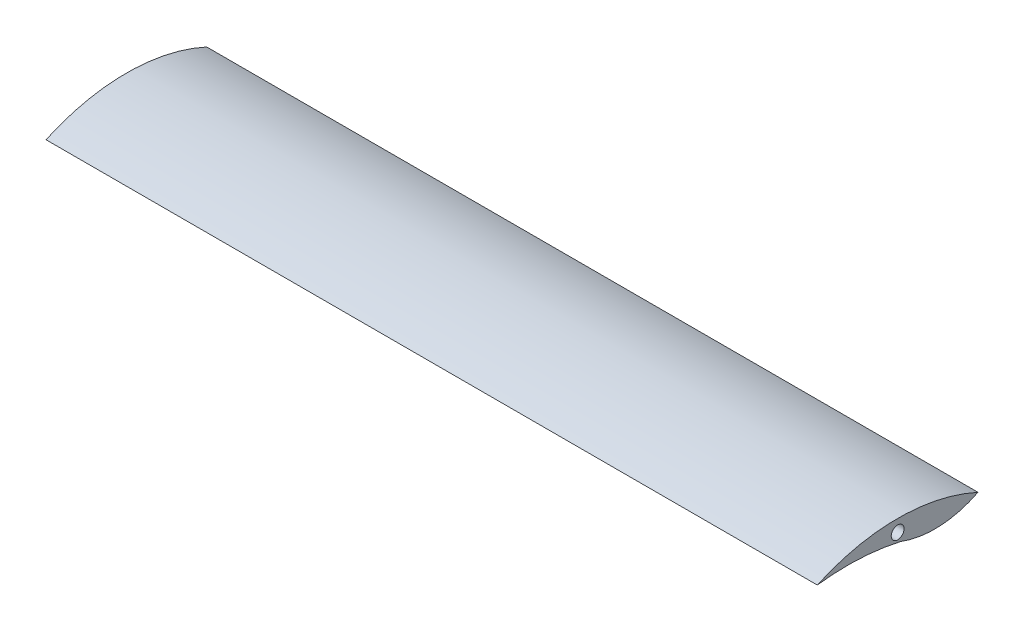
ISO-10303-21;
HEADER;
FILE_DESCRIPTION(('STEP AP214'),'2;1');
FILE_NAME('part.step','',(''),(''),'','','');
FILE_SCHEMA(('AUTOMOTIVE_DESIGN { 1 0 10303 214 1 1 1 1 }'));
ENDSEC;
DATA;
#1=APPLICATION_CONTEXT('core data for automotive mechanical design processes');
#2=APPLICATION_PROTOCOL_DEFINITION('international standard','automotive_design',2000,#1);
#3=PRODUCT_CONTEXT('',#1,'mechanical');
#4=PRODUCT('Part','Part','',(#3));
#5=PRODUCT_RELATED_PRODUCT_CATEGORY('part','',(#4));
#6=PRODUCT_DEFINITION_FORMATION('','',#4);
#7=PRODUCT_DEFINITION_CONTEXT('part definition',#1,'design');
#8=PRODUCT_DEFINITION('design','',#6,#7);
#9=PRODUCT_DEFINITION_SHAPE('','',#8);
#10=(LENGTH_UNIT() NAMED_UNIT(*) SI_UNIT(.MILLI.,.METRE.));
#11=(NAMED_UNIT(*) PLANE_ANGLE_UNIT() SI_UNIT($,.RADIAN.));
#12=(NAMED_UNIT(*) SI_UNIT($,.STERADIAN.) SOLID_ANGLE_UNIT());
#13=UNCERTAINTY_MEASURE_WITH_UNIT(LENGTH_MEASURE(1.E-05),#10,'distance_accuracy_value','');
#14=(GEOMETRIC_REPRESENTATION_CONTEXT(3) GLOBAL_UNCERTAINTY_ASSIGNED_CONTEXT((#13)) GLOBAL_UNIT_ASSIGNED_CONTEXT((#10,
#11,#12)) REPRESENTATION_CONTEXT('',''));
#15=CARTESIAN_POINT('',(0.,0.,0.));
#16=DIRECTION('',(0.,0.,1.));
#17=DIRECTION('',(1.,0.,0.));
#18=AXIS2_PLACEMENT_3D('',#15,#16,#17);
#19=CARTESIAN_POINT('',(691.064835988685,25.6234128471369,-70.694287617522));
#20=DIRECTION('',(-1.,0.,0.));
#21=DIRECTION('',(0.,0.,1.));
#22=AXIS2_PLACEMENT_3D('',#19,#20,#21);
#23=CYLINDRICAL_SURFACE('',#22,22.3730308435729);
#24=CARTESIAN_POINT('',(628.064835988685,25.6234128471369,-70.694287617522));
#25=DIRECTION('',(1.,0.,0.));
#26=DIRECTION('',(0.,0.,-1.));
#27=AXIS2_PLACEMENT_3D('',#24,#25,#26);
#28=CIRCLE('',#27,22.3730308435729);
#29=CARTESIAN_POINT('',(628.064835988685,3.55051975744539,-67.0419048639604));
#30=VERTEX_POINT('',#29);
#31=CARTESIAN_POINT('',(628.064835988685,3.35107125596236,-72.8145020343916));
#32=VERTEX_POINT('',#31);
#33=EDGE_CURVE('E399',#30,#32,#28,.T.);
#34=ORIENTED_EDGE('',*,*,#33,.F.);
#35=DIRECTION('',(1.,0.,0.));
#36=VECTOR('',#35,1.);
#37=CARTESIAN_POINT('',(628.064835988685,3.55051975744539,-67.0419048639604));
#38=LINE('',#37,#36);
#39=CARTESIAN_POINT('',(631.064835988685,3.55051975744539,-67.0419048639604));
#40=VERTEX_POINT('',#39);
#41=EDGE_CURVE('E297',#30,#40,#38,.T.);
#42=ORIENTED_EDGE('',*,*,#41,.T.);
#43=CARTESIAN_POINT('',(631.064835988685,25.6234128471369,-70.694287617522));
#44=DIRECTION('',(1.,0.,0.));
#45=DIRECTION('',(0.,0.,-1.));
#46=AXIS2_PLACEMENT_3D('',#43,#44,#45);
#47=CIRCLE('',#46,22.3730308435729);
#48=CARTESIAN_POINT('',(631.064835988685,3.35107125596236,-72.8145020343916));
#49=VERTEX_POINT('',#48);
#50=EDGE_CURVE('E396',#40,#49,#47,.T.);
#51=ORIENTED_EDGE('',*,*,#50,.T.);
#52=DIRECTION('',(1.,0.,0.));
#53=VECTOR('',#52,1.);
#54=CARTESIAN_POINT('',(628.064835988685,3.35107125596236,-72.8145020343916));
#55=LINE('',#54,#53);
#56=EDGE_CURVE('E310',#32,#49,#55,.T.);
#57=ORIENTED_EDGE('',*,*,#56,.F.);
#58=EDGE_LOOP('',(#34,#42,#51,#57));
#59=FACE_BOUND('',#58,.T.);
#60=CARTESIAN_POINT('',(511.064835988685,25.6234128471369,-70.694287617522));
#61=DIRECTION('',(1.,0.,0.));
#62=DIRECTION('',(0.,0.,-1.));
#63=AXIS2_PLACEMENT_3D('',#60,#61,#62);
#64=CIRCLE('',#63,22.3730308435729);
#65=CARTESIAN_POINT('',(511.064835988685,4.72444414795623,-62.7076978297507));
#66=VERTEX_POINT('',#65);
#67=CARTESIAN_POINT('',(511.064835988685,5.65231082089548,-80.7793058616761));
#68=VERTEX_POINT('',#67);
#69=EDGE_CURVE('E385',#66,#68,#64,.T.);
#70=ORIENTED_EDGE('',*,*,#69,.T.);
#71=DIRECTION('',(-1.,0.,0.));
#72=VECTOR('',#71,1.);
#73=CARTESIAN_POINT('',(691.064835988685,5.65231082089548,-80.7793058616761));
#74=LINE('',#73,#72);
#75=CARTESIAN_POINT('',(691.064835988685,5.65231082089548,-80.7793058616761));
#76=VERTEX_POINT('',#75);
#77=EDGE_CURVE('E390',#76,#68,#74,.T.);
#78=ORIENTED_EDGE('',*,*,#77,.F.);
#79=CARTESIAN_POINT('',(691.064835988685,25.6234128471369,-70.694287617522));
#80=DIRECTION('',(1.,0.,0.));
#81=DIRECTION('',(0.,0.,-1.));
#82=AXIS2_PLACEMENT_3D('',#79,#80,#81);
#83=CIRCLE('',#82,22.3730308435729);
#84=CARTESIAN_POINT('',(691.064835988685,4.72444414795623,-62.7076978297507));
#85=VERTEX_POINT('',#84);
#86=EDGE_CURVE('E377',#85,#76,#83,.T.);
#87=ORIENTED_EDGE('',*,*,#86,.F.);
#88=DIRECTION('',(-1.,0.,0.));
#89=VECTOR('',#88,1.);
#90=CARTESIAN_POINT('',(691.064835988685,4.72444414795623,-62.7076978297507));
#91=LINE('',#90,#89);
#92=EDGE_CURVE('E393',#85,#66,#91,.T.);
#93=ORIENTED_EDGE('',*,*,#92,.T.);
#94=EDGE_LOOP('',(#70,#78,#87,#93));
#95=FACE_BOUND('',#94,.T.);
#96=DIRECTION('',(-1.,0.,0.));
#97=VECTOR('',#96,1.);
#98=CARTESIAN_POINT('',(574.564835988685,3.55051975744539,-67.0419048639604));
#99=LINE('',#98,#97);
#100=CARTESIAN_POINT('',(574.564835988685,3.55051975744539,-67.0419048639604));
#101=VERTEX_POINT('',#100);
#102=CARTESIAN_POINT('',(572.064835988685,3.55051975744539,-67.0419048639604));
#103=VERTEX_POINT('',#102);
#104=EDGE_CURVE('E53',#101,#103,#99,.T.);
#105=ORIENTED_EDGE('',*,*,#104,.F.);
#106=CARTESIAN_POINT('',(574.564835988685,25.6234128471386,-70.694287617522));
#107=DIRECTION('',(-1.,0.,0.));
#108=DIRECTION('',(0.,0.,1.));
#109=AXIS2_PLACEMENT_3D('',#106,#107,#108);
#110=CIRCLE('',#109,22.3730308435746);
#111=CARTESIAN_POINT('',(574.564835988685,3.35107125596236,-72.8145020343916));
#112=VERTEX_POINT('',#111);
#113=EDGE_CURVE('E198',#112,#101,#110,.T.);
#114=ORIENTED_EDGE('',*,*,#113,.F.);
#115=DIRECTION('',(-1.,0.,0.));
#116=VECTOR('',#115,1.);
#117=CARTESIAN_POINT('',(574.564835988685,3.35107125596236,-72.8145020343916));
#118=LINE('',#117,#116);
#119=CARTESIAN_POINT('',(572.064835988685,3.35107125596235,-72.8145020343916));
#120=VERTEX_POINT('',#119);
#121=EDGE_CURVE('E221',#112,#120,#118,.T.);
#122=ORIENTED_EDGE('',*,*,#121,.T.);
#123=CARTESIAN_POINT('',(572.064835988685,25.6234128471386,-70.694287617522));
#124=DIRECTION('',(-1.,0.,0.));
#125=DIRECTION('',(0.,0.,1.));
#126=AXIS2_PLACEMENT_3D('',#123,#124,#125);
#127=CIRCLE('',#126,22.3730308435746);
#128=EDGE_CURVE('E58',#120,#103,#127,.T.);
#129=ORIENTED_EDGE('',*,*,#128,.T.);
#130=EDGE_LOOP('',(#105,#114,#122,#129));
#131=FACE_BOUND('',#130,.T.);
#132=ADVANCED_FACE('F38',(#59,#95,#131),#23,.T.);
#133=CARTESIAN_POINT('',(691.064835988685,-49.7322976915493,-50.3705846102136));
#134=DIRECTION('',(-1.,0.,0.));
#135=DIRECTION('',(0.,0.,1.));
#136=AXIS2_PLACEMENT_3D('',#133,#134,#135);
#137=CYLINDRICAL_SURFACE('',#136,55.836736064765);
#138=CARTESIAN_POINT('',(511.064835988685,-49.7322976915493,-50.3705846102136));
#139=DIRECTION('',(-1.,0.,0.));
#140=DIRECTION('',(0.,0.,1.));
#141=AXIS2_PLACEMENT_3D('',#138,#139,#140);
#142=CIRCLE('',#141,55.836736064765);
#143=CARTESIAN_POINT('',(511.064835988685,5.65231082089547,-43.2793058616761));
#144=VERTEX_POINT('',#143);
#145=EDGE_CURVE('E371',#144,#66,#142,.T.);
#146=ORIENTED_EDGE('',*,*,#145,.T.);
#147=ORIENTED_EDGE('',*,*,#92,.F.);
#148=CARTESIAN_POINT('',(691.064835988685,-49.7322976915493,-50.3705846102136));
#149=DIRECTION('',(-1.,0.,0.));
#150=DIRECTION('',(0.,0.,1.));
#151=AXIS2_PLACEMENT_3D('',#148,#149,#150);
#152=CIRCLE('',#151,55.836736064765);
#153=CARTESIAN_POINT('',(691.064835988685,5.65231082089547,-43.2793058616761));
#154=VERTEX_POINT('',#153);
#155=EDGE_CURVE('E374',#154,#85,#152,.T.);
#156=ORIENTED_EDGE('',*,*,#155,.F.);
#157=DIRECTION('',(-1.,0.,0.));
#158=VECTOR('',#157,1.);
#159=CARTESIAN_POINT('',(691.064835988685,5.65231082089547,-43.2793058616761));
#160=LINE('',#159,#158);
#161=EDGE_CURVE('E382',#154,#144,#160,.T.);
#162=ORIENTED_EDGE('',*,*,#161,.T.);
#163=EDGE_LOOP('',(#146,#147,#156,#162));
#164=FACE_BOUND('',#163,.T.);
#165=DIRECTION('',(1.,0.,0.));
#166=VECTOR('',#165,1.);
#167=CARTESIAN_POINT('',(628.064835988685,5.27035068376812,-59.9856647485911));
#168=LINE('',#167,#166);
#169=CARTESIAN_POINT('',(628.064835988685,5.27035068376812,-59.9856647485911));
#170=VERTEX_POINT('',#169);
#171=CARTESIAN_POINT('',(631.064835988685,5.27035068376812,-59.9856647485911));
#172=VERTEX_POINT('',#171);
#173=EDGE_CURVE('E353',#170,#172,#168,.T.);
#174=ORIENTED_EDGE('',*,*,#173,.F.);
#175=CARTESIAN_POINT('',(628.064835988685,-49.732297691608,-50.3705846102061));
#176=DIRECTION('',(1.,0.,0.));
#177=DIRECTION('',(0.,0.,1.));
#178=AXIS2_PLACEMENT_3D('',#175,#176,#177);
#179=CIRCLE('',#178,55.8367360648242);
#180=CARTESIAN_POINT('',(628.064835988685,5.92605335036914,-54.8302991370421));
#181=VERTEX_POINT('',#180);
#182=EDGE_CURVE('E330',#170,#181,#179,.T.);
#183=ORIENTED_EDGE('',*,*,#182,.T.);
#184=DIRECTION('',(1.,0.,0.));
#185=VECTOR('',#184,1.);
#186=CARTESIAN_POINT('',(628.064835988685,5.92605335036914,-54.8302991370421));
#187=LINE('',#186,#185);
#188=CARTESIAN_POINT('',(631.064835988685,5.92605335036914,-54.8302991370421));
#189=VERTEX_POINT('',#188);
#190=EDGE_CURVE('E342',#181,#189,#187,.T.);
#191=ORIENTED_EDGE('',*,*,#190,.T.);
#192=CARTESIAN_POINT('',(631.064835988685,-49.732297691608,-50.3705846102061));
#193=DIRECTION('',(1.,0.,0.));
#194=DIRECTION('',(0.,0.,1.));
#195=AXIS2_PLACEMENT_3D('',#192,#193,#194);
#196=CIRCLE('',#195,55.8367360648242);
#197=EDGE_CURVE('E327',#172,#189,#196,.T.);
#198=ORIENTED_EDGE('',*,*,#197,.F.);
#199=EDGE_LOOP('',(#174,#183,#191,#198));
#200=FACE_BOUND('',#199,.T.);
#201=DIRECTION('',(-1.,0.,0.));
#202=VECTOR('',#201,1.);
#203=CARTESIAN_POINT('',(574.564835988685,5.92605335036914,-54.8302991370421));
#204=LINE('',#203,#202);
#205=CARTESIAN_POINT('',(574.564835988685,5.92605335036914,-54.8302991370421));
#206=VERTEX_POINT('',#205);
#207=CARTESIAN_POINT('',(572.064835988685,5.92605335036914,-54.8302991370421));
#208=VERTEX_POINT('',#207);
#209=EDGE_CURVE('E271',#206,#208,#204,.T.);
#210=ORIENTED_EDGE('',*,*,#209,.F.);
#211=CARTESIAN_POINT('',(574.564835988685,-49.7322976915493,-50.3705846102136));
#212=DIRECTION('',(1.,0.,0.));
#213=DIRECTION('',(0.,0.,-1.));
#214=AXIS2_PLACEMENT_3D('',#211,#212,#213);
#215=CIRCLE('',#214,55.836736064765);
#216=CARTESIAN_POINT('',(574.564835988685,5.27035068376812,-59.9856647485911));
#217=VERTEX_POINT('',#216);
#218=EDGE_CURVE('E11',#206,#217,#215,.F.);
#219=ORIENTED_EDGE('',*,*,#218,.T.);
#220=DIRECTION('',(-1.,0.,0.));
#221=VECTOR('',#220,1.);
#222=CARTESIAN_POINT('',(574.564835988685,5.27035068376812,-59.9856647485911));
#223=LINE('',#222,#221);
#224=CARTESIAN_POINT('',(572.064835988685,5.27035068376819,-59.9856647485907));
#225=VERTEX_POINT('',#224);
#226=EDGE_CURVE('E258',#217,#225,#223,.T.);
#227=ORIENTED_EDGE('',*,*,#226,.T.);
#228=CARTESIAN_POINT('',(572.064835988685,-49.7322976915493,-50.3705846102136));
#229=DIRECTION('',(1.,0.,0.));
#230=DIRECTION('',(0.,0.,-1.));
#231=AXIS2_PLACEMENT_3D('',#228,#229,#230);
#232=CIRCLE('',#231,55.836736064765);
#233=EDGE_CURVE('E46',#208,#225,#232,.F.);
#234=ORIENTED_EDGE('',*,*,#233,.F.);
#235=EDGE_LOOP('',(#210,#219,#227,#234));
#236=FACE_BOUND('',#235,.T.);
#237=ADVANCED_FACE('F40',(#164,#200,#236),#137,.F.);
#238=CARTESIAN_POINT('',(691.064835988685,-35.2553596089885,-62.0293058616761));
#239=DIRECTION('',(-1.,0.,0.));
#240=DIRECTION('',(0.,0.,1.));
#241=AXIS2_PLACEMENT_3D('',#238,#239,#240);
#242=CYLINDRICAL_SURFACE('',#241,45.);
#243=CARTESIAN_POINT('',(511.064835988685,-35.2553596089885,-62.0293058616761));
#244=DIRECTION('',(1.,0.,0.));
#245=DIRECTION('',(0.,0.,1.));
#246=AXIS2_PLACEMENT_3D('',#243,#244,#245);
#247=CIRCLE('',#246,45.);
#248=EDGE_CURVE('E378',#68,#144,#247,.T.);
#249=ORIENTED_EDGE('',*,*,#248,.T.);
#250=ORIENTED_EDGE('',*,*,#161,.F.);
#251=CARTESIAN_POINT('',(691.064835988685,-35.2553596089885,-62.0293058616761));
#252=DIRECTION('',(1.,0.,0.));
#253=DIRECTION('',(0.,0.,1.));
#254=AXIS2_PLACEMENT_3D('',#251,#252,#253);
#255=CIRCLE('',#254,45.);
#256=EDGE_CURVE('E380',#76,#154,#255,.T.);
#257=ORIENTED_EDGE('',*,*,#256,.F.);
#258=ORIENTED_EDGE('',*,*,#77,.T.);
#259=EDGE_LOOP('',(#249,#250,#257,#258));
#260=FACE_BOUND('',#259,.T.);
#261=ADVANCED_FACE('F442',(#260),#242,.T.);
#262=CARTESIAN_POINT('',(691.064835988685,-12.0544424222062,-60.5324361138678));
#263=DIRECTION('',(-1.,0.,0.));
#264=DIRECTION('',(0.,0.,1.));
#265=AXIS2_PLACEMENT_3D('',#262,#263,#264);
#266=PLANE('',#265);
#267=CARTESIAN_POINT('',(691.064835988685,6.91806916800367,-62.0293058616757));
#268=DIRECTION('',(-1.,0.,0.));
#269=DIRECTION('',(0.,0.,1.));
#270=AXIS2_PLACEMENT_3D('',#267,#268,#269);
#271=CIRCLE('',#270,1.5);
#272=CARTESIAN_POINT('',(691.064835988685,6.91806916800367,-60.5293058616757));
#273=VERTEX_POINT('',#272);
#274=EDGE_CURVE('E356',#273,#273,#271,.T.);
#275=ORIENTED_EDGE('',*,*,#274,.T.);
#276=EDGE_LOOP('',(#275));
#277=FACE_BOUND('',#276,.T.);
#278=ORIENTED_EDGE('',*,*,#155,.T.);
#279=ORIENTED_EDGE('',*,*,#86,.T.);
#280=ORIENTED_EDGE('',*,*,#256,.T.);
#281=EDGE_LOOP('',(#278,#279,#280));
#282=FACE_BOUND('',#281,.T.);
#283=ADVANCED_FACE('F449',(#277,#282),#266,.F.);
#284=CARTESIAN_POINT('',(511.064835988685,-12.0544424222062,-60.5324361138678));
#285=DIRECTION('',(-1.,0.,0.));
#286=DIRECTION('',(0.,0.,1.));
#287=AXIS2_PLACEMENT_3D('',#284,#285,#286);
#288=PLANE('',#287);
#289=CARTESIAN_POINT('',(511.064835988685,6.91806916800367,-62.0293058616757));
#290=DIRECTION('',(-1.,0.,0.));
#291=DIRECTION('',(0.,0.,1.));
#292=AXIS2_PLACEMENT_3D('',#289,#290,#291);
#293=CIRCLE('',#292,1.5);
#294=CARTESIAN_POINT('',(511.064835988685,6.91806916800367,-60.5293058616757));
#295=VERTEX_POINT('',#294);
#296=EDGE_CURVE('E365',#295,#295,#293,.T.);
#297=ORIENTED_EDGE('',*,*,#296,.F.);
#298=EDGE_LOOP('',(#297));
#299=FACE_BOUND('',#298,.T.);
#300=ORIENTED_EDGE('',*,*,#145,.F.);
#301=ORIENTED_EDGE('',*,*,#248,.F.);
#302=ORIENTED_EDGE('',*,*,#69,.F.);
#303=EDGE_LOOP('',(#300,#301,#302));
#304=FACE_BOUND('',#303,.T.);
#305=ADVANCED_FACE('F451',(#299,#304),#288,.T.);
#306=CARTESIAN_POINT('',(515.564835988685,6.91806916800367,-62.0293058616757));
#307=DIRECTION('',(-1.,0.,0.));
#308=DIRECTION('',(0.,0.,1.));
#309=AXIS2_PLACEMENT_3D('',#306,#307,#308);
#310=CYLINDRICAL_SURFACE('',#309,1.5);
#311=CARTESIAN_POINT('',(515.564835988685,6.91806916800367,-62.0293058616757));
#312=DIRECTION('',(-1.,0.,0.));
#313=DIRECTION('',(0.,0.,1.));
#314=AXIS2_PLACEMENT_3D('',#311,#312,#313);
#315=CIRCLE('',#314,1.5);
#316=CARTESIAN_POINT('',(515.564835988685,6.91806916800367,-60.5293058616757));
#317=VERTEX_POINT('',#316);
#318=EDGE_CURVE('E368',#317,#317,#315,.T.);
#319=ORIENTED_EDGE('',*,*,#318,.F.);
#320=EDGE_LOOP('',(#319));
#321=FACE_BOUND('',#320,.T.);
#322=ORIENTED_EDGE('',*,*,#296,.T.);
#323=EDGE_LOOP('',(#322));
#324=FACE_BOUND('',#323,.T.);
#325=ADVANCED_FACE('F454',(#321,#324),#310,.F.);
#326=CARTESIAN_POINT('',(515.564835988685,6.91806916800367,-62.0293058616757));
#327=DIRECTION('',(-1.,0.,0.));
#328=DIRECTION('',(0.,0.,1.));
#329=AXIS2_PLACEMENT_3D('',#326,#327,#328);
#330=PLANE('',#329);
#331=ORIENTED_EDGE('',*,*,#318,.T.);
#332=EDGE_LOOP('',(#331));
#333=FACE_BOUND('',#332,.T.);
#334=ADVANCED_FACE('F461',(#333),#330,.T.);
#335=CARTESIAN_POINT('',(686.564835988685,6.91806916800367,-62.0293058616757));
#336=DIRECTION('',(1.,0.,0.));
#337=DIRECTION('',(0.,0.,-1.));
#338=AXIS2_PLACEMENT_3D('',#335,#336,#337);
#339=CYLINDRICAL_SURFACE('',#338,1.5);
#340=CARTESIAN_POINT('',(686.564835988685,6.91806916800367,-62.0293058616757));
#341=DIRECTION('',(-1.,0.,0.));
#342=DIRECTION('',(0.,0.,1.));
#343=AXIS2_PLACEMENT_3D('',#340,#341,#342);
#344=CIRCLE('',#343,1.5);
#345=CARTESIAN_POINT('',(686.564835988685,6.91806916800367,-60.5293058616757));
#346=VERTEX_POINT('',#345);
#347=EDGE_CURVE('E362',#346,#346,#344,.T.);
#348=ORIENTED_EDGE('',*,*,#347,.T.);
#349=EDGE_LOOP('',(#348));
#350=FACE_BOUND('',#349,.T.);
#351=ORIENTED_EDGE('',*,*,#274,.F.);
#352=EDGE_LOOP('',(#351));
#353=FACE_BOUND('',#352,.T.);
#354=ADVANCED_FACE('F465',(#350,#353),#339,.F.);
#355=CARTESIAN_POINT('',(686.564835988685,6.91806916800367,-62.0293058616757));
#356=DIRECTION('',(1.,0.,0.));
#357=DIRECTION('',(0.,0.,1.));
#358=AXIS2_PLACEMENT_3D('',#355,#356,#357);
#359=PLANE('',#358);
#360=ORIENTED_EDGE('',*,*,#347,.F.);
#361=EDGE_LOOP('',(#360));
#362=FACE_BOUND('',#361,.T.);
#363=ADVANCED_FACE('F469',(#362),#359,.T.);
#364=CARTESIAN_POINT('',(628.064835988685,5.27035068376812,-59.9856647485911));
#365=DIRECTION('',(0.,0.,-1.));
#366=DIRECTION('',(-1.,0.,0.));
#367=AXIS2_PLACEMENT_3D('',#364,#365,#366);
#368=PLANE('',#367);
#369=DIRECTION('',(0.,1.,0.));
#370=VECTOR('',#369,1.);
#371=CARTESIAN_POINT('',(631.064835988685,5.27035068376812,-59.9856647485911));
#372=LINE('',#371,#370);
#373=CARTESIAN_POINT('',(631.064835988685,2.01514026523623,-59.9856647485911));
#374=VERTEX_POINT('',#373);
#375=EDGE_CURVE('E333',#374,#172,#372,.T.);
#376=ORIENTED_EDGE('',*,*,#375,.F.);
#377=DIRECTION('',(1.,0.,0.));
#378=VECTOR('',#377,1.);
#379=CARTESIAN_POINT('',(628.064835988685,2.01514026523623,-59.9856647485911));
#380=LINE('',#379,#378);
#381=CARTESIAN_POINT('',(628.064835988685,2.01514026523623,-59.9856647485911));
#382=VERTEX_POINT('',#381);
#383=EDGE_CURVE('E357',#382,#374,#380,.T.);
#384=ORIENTED_EDGE('',*,*,#383,.F.);
#385=DIRECTION('',(0.,1.,0.));
#386=VECTOR('',#385,1.);
#387=CARTESIAN_POINT('',(628.064835988685,5.27035068376812,-59.9856647485911));
#388=LINE('',#387,#386);
#389=EDGE_CURVE('E339',#382,#170,#388,.T.);
#390=ORIENTED_EDGE('',*,*,#389,.T.);
#391=ORIENTED_EDGE('',*,*,#173,.T.);
#392=EDGE_LOOP('',(#376,#384,#390,#391));
#393=FACE_BOUND('',#392,.T.);
#394=ADVANCED_FACE('F473',(#393),#368,.T.);
#395=CARTESIAN_POINT('',(628.064835988685,0.344776051326764,-57.5746638370332));
#396=DIRECTION('',(1.,0.,0.));
#397=DIRECTION('',(0.,0.,-1.));
#398=AXIS2_PLACEMENT_3D('',#395,#396,#397);
#399=CYLINDRICAL_SURFACE('',#398,2.93309427101185);
#400=CARTESIAN_POINT('',(631.064835988685,0.344776051326764,-57.5746638370332));
#401=DIRECTION('',(1.,0.,0.));
#402=DIRECTION('',(0.,0.,-1.));
#403=AXIS2_PLACEMENT_3D('',#400,#401,#402);
#404=CIRCLE('',#403,2.93309427101185);
#405=CARTESIAN_POINT('',(631.064835988685,1.37991101648129,-54.8302991370421));
#406=VERTEX_POINT('',#405);
#407=EDGE_CURVE('E348',#406,#374,#404,.T.);
#408=ORIENTED_EDGE('',*,*,#407,.F.);
#409=DIRECTION('',(1.,0.,0.));
#410=VECTOR('',#409,1.);
#411=CARTESIAN_POINT('',(628.064835988685,1.37991101648129,-54.8302991370421));
#412=LINE('',#411,#410);
#413=CARTESIAN_POINT('',(628.064835988685,1.37991101648129,-54.8302991370421));
#414=VERTEX_POINT('',#413);
#415=EDGE_CURVE('E359',#414,#406,#412,.T.);
#416=ORIENTED_EDGE('',*,*,#415,.F.);
#417=CARTESIAN_POINT('',(628.064835988685,0.344776051326764,-57.5746638370332));
#418=DIRECTION('',(1.,0.,0.));
#419=DIRECTION('',(0.,0.,-1.));
#420=AXIS2_PLACEMENT_3D('',#417,#418,#419);
#421=CIRCLE('',#420,2.93309427101185);
#422=EDGE_CURVE('E336',#414,#382,#421,.T.);
#423=ORIENTED_EDGE('',*,*,#422,.T.);
#424=ORIENTED_EDGE('',*,*,#383,.T.);
#425=EDGE_LOOP('',(#408,#416,#423,#424));
#426=FACE_BOUND('',#425,.T.);
#427=ADVANCED_FACE('F479',(#426),#399,.T.);
#428=CARTESIAN_POINT('',(628.064835988685,5.92605335036914,-54.8302991370421));
#429=DIRECTION('',(0.,0.,1.));
#430=DIRECTION('',(0.,-1.,0.));
#431=AXIS2_PLACEMENT_3D('',#428,#429,#430);
#432=PLANE('',#431);
#433=DIRECTION('',(0.,-1.,0.));
#434=VECTOR('',#433,1.);
#435=CARTESIAN_POINT('',(631.064835988685,5.92605335036914,-54.8302991370421));
#436=LINE('',#435,#434);
#437=EDGE_CURVE('E345',#189,#406,#436,.T.);
#438=ORIENTED_EDGE('',*,*,#437,.F.);
#439=ORIENTED_EDGE('',*,*,#190,.F.);
#440=DIRECTION('',(0.,-1.,0.));
#441=VECTOR('',#440,1.);
#442=CARTESIAN_POINT('',(628.064835988685,5.92605335036914,-54.8302991370421));
#443=LINE('',#442,#441);
#444=EDGE_CURVE('E332',#181,#414,#443,.T.);
#445=ORIENTED_EDGE('',*,*,#444,.T.);
#446=ORIENTED_EDGE('',*,*,#415,.T.);
#447=EDGE_LOOP('',(#438,#439,#445,#446));
#448=FACE_BOUND('',#447,.T.);
#449=ADVANCED_FACE('F475',(#448),#432,.T.);
#450=CARTESIAN_POINT('',(628.064835988685,-49.732297691608,-50.3705846102061));
#451=DIRECTION('',(-1.,0.,0.));
#452=DIRECTION('',(0.,0.,1.));
#453=AXIS2_PLACEMENT_3D('',#450,#451,#452);
#454=PLANE('',#453);
#455=CARTESIAN_POINT('',(628.064835988685,0.27446300684279,-57.5439596292277));
#456=DIRECTION('',(1.,0.,0.));
#457=DIRECTION('',(0.,0.,-1.));
#458=AXIS2_PLACEMENT_3D('',#455,#456,#457);
#459=CIRCLE('',#458,1.5);
#460=CARTESIAN_POINT('',(628.064835988685,0.27446300684279,-59.0439596292277));
#461=VERTEX_POINT('',#460);
#462=EDGE_CURVE('E324',#461,#461,#459,.T.);
#463=ORIENTED_EDGE('',*,*,#462,.T.);
#464=EDGE_LOOP('',(#463));
#465=FACE_BOUND('',#464,.T.);
#466=ORIENTED_EDGE('',*,*,#182,.F.);
#467=ORIENTED_EDGE('',*,*,#389,.F.);
#468=ORIENTED_EDGE('',*,*,#422,.F.);
#469=ORIENTED_EDGE('',*,*,#444,.F.);
#470=EDGE_LOOP('',(#466,#467,#468,#469));
#471=FACE_BOUND('',#470,.T.);
#472=ADVANCED_FACE('F478',(#465,#471),#454,.T.);
#473=CARTESIAN_POINT('',(631.064835988685,-49.732297691608,-50.3705846102061));
#474=DIRECTION('',(-1.,0.,0.));
#475=DIRECTION('',(0.,0.,1.));
#476=AXIS2_PLACEMENT_3D('',#473,#474,#475);
#477=PLANE('',#476);
#478=CARTESIAN_POINT('',(631.064835988685,0.27446300684279,-57.5439596292277));
#479=DIRECTION('',(1.,0.,0.));
#480=DIRECTION('',(0.,0.,-1.));
#481=AXIS2_PLACEMENT_3D('',#478,#479,#480);
#482=CIRCLE('',#481,1.5);
#483=CARTESIAN_POINT('',(631.064835988685,0.27446300684279,-59.0439596292277));
#484=VERTEX_POINT('',#483);
#485=EDGE_CURVE('E313',#484,#484,#482,.T.);
#486=ORIENTED_EDGE('',*,*,#485,.F.);
#487=EDGE_LOOP('',(#486));
#488=FACE_BOUND('',#487,.T.);
#489=ORIENTED_EDGE('',*,*,#197,.T.);
#490=ORIENTED_EDGE('',*,*,#437,.T.);
#491=ORIENTED_EDGE('',*,*,#407,.T.);
#492=ORIENTED_EDGE('',*,*,#375,.T.);
#493=EDGE_LOOP('',(#489,#490,#491,#492));
#494=FACE_BOUND('',#493,.T.);
#495=ADVANCED_FACE('F487',(#488,#494),#477,.F.);
#496=CARTESIAN_POINT('',(628.064835988685,0.27446300684279,-57.5439596292277));
#497=DIRECTION('',(1.,0.,0.));
#498=DIRECTION('',(0.,0.,-1.));
#499=AXIS2_PLACEMENT_3D('',#496,#497,#498);
#500=CYLINDRICAL_SURFACE('',#499,1.5);
#501=ORIENTED_EDGE('',*,*,#462,.F.);
#502=EDGE_LOOP('',(#501));
#503=FACE_BOUND('',#502,.T.);
#504=ORIENTED_EDGE('',*,*,#485,.T.);
#505=EDGE_LOOP('',(#504));
#506=FACE_BOUND('',#505,.T.);
#507=ADVANCED_FACE('F490',(#503,#506),#500,.F.);
#508=CARTESIAN_POINT('',(628.064835988685,2.98733257479283,-71.5752971285778));
#509=DIRECTION('',(0.,-0.95951907237231,-0.281643657400238));
#510=DIRECTION('',(0.,0.281643657400238,-0.95951907237231));
#511=AXIS2_PLACEMENT_3D('',#508,#509,#510);
#512=PLANE('',#511);
#513=DIRECTION('',(0.,0.281643657400238,-0.95951907237231));
#514=VECTOR('',#513,1.);
#515=CARTESIAN_POINT('',(631.064835988685,2.98733257479283,-71.5752971285778));
#516=LINE('',#515,#514);
#517=CARTESIAN_POINT('',(631.064835988685,2.98733257479283,-71.5752971285778));
#518=VERTEX_POINT('',#517);
#519=EDGE_CURVE('E285',#518,#49,#516,.T.);
#520=ORIENTED_EDGE('',*,*,#519,.F.);
#521=DIRECTION('',(1.,0.,0.));
#522=VECTOR('',#521,1.);
#523=CARTESIAN_POINT('',(628.064835988685,2.98733257479283,-71.5752971285778));
#524=LINE('',#523,#522);
#525=CARTESIAN_POINT('',(628.064835988685,2.98733257479283,-71.5752971285778));
#526=VERTEX_POINT('',#525);
#527=EDGE_CURVE('E314',#526,#518,#524,.T.);
#528=ORIENTED_EDGE('',*,*,#527,.F.);
#529=DIRECTION('',(0.,0.281643657400238,-0.95951907237231));
#530=VECTOR('',#529,1.);
#531=CARTESIAN_POINT('',(628.064835988685,2.98733257479283,-71.5752971285778));
#532=LINE('',#531,#530);
#533=EDGE_CURVE('E294',#526,#32,#532,.T.);
#534=ORIENTED_EDGE('',*,*,#533,.T.);
#535=ORIENTED_EDGE('',*,*,#56,.T.);
#536=EDGE_LOOP('',(#520,#528,#534,#535));
#537=FACE_BOUND('',#536,.T.);
#538=ADVANCED_FACE('F497',(#537),#512,.T.);
#539=CARTESIAN_POINT('',(628.064835988685,2.63369977207975,-71.6597187158975));
#540=DIRECTION('',(1.,0.,0.));
#541=DIRECTION('',(0.,0.,-1.));
#542=AXIS2_PLACEMENT_3D('',#539,#540,#541);
#543=CYLINDRICAL_SURFACE('',#542,0.363570025662564);
#544=CARTESIAN_POINT('',(631.064835988685,2.63369977207975,-71.6597187158975));
#545=DIRECTION('',(-1.,0.,0.));
#546=DIRECTION('',(0.,0.,1.));
#547=AXIS2_PLACEMENT_3D('',#544,#545,#546);
#548=CIRCLE('',#547,0.363570025662564);
#549=CARTESIAN_POINT('',(631.064835988685,2.39139687724934,-71.3886606580629));
#550=VERTEX_POINT('',#549);
#551=EDGE_CURVE('E306',#550,#518,#548,.T.);
#552=ORIENTED_EDGE('',*,*,#551,.F.);
#553=DIRECTION('',(1.,0.,0.));
#554=VECTOR('',#553,1.);
#555=CARTESIAN_POINT('',(628.064835988685,2.39139687724934,-71.3886606580629));
#556=LINE('',#555,#554);
#557=CARTESIAN_POINT('',(628.064835988685,2.39139687724934,-71.3886606580629));
#558=VERTEX_POINT('',#557);
#559=EDGE_CURVE('E316',#558,#550,#556,.T.);
#560=ORIENTED_EDGE('',*,*,#559,.F.);
#561=CARTESIAN_POINT('',(628.064835988685,2.63369977207975,-71.6597187158975));
#562=DIRECTION('',(-1.,0.,0.));
#563=DIRECTION('',(0.,0.,1.));
#564=AXIS2_PLACEMENT_3D('',#561,#562,#563);
#565=CIRCLE('',#564,0.363570025662564);
#566=EDGE_CURVE('E291',#558,#526,#565,.T.);
#567=ORIENTED_EDGE('',*,*,#566,.T.);
#568=ORIENTED_EDGE('',*,*,#527,.T.);
#569=EDGE_LOOP('',(#552,#560,#567,#568));
#570=FACE_BOUND('',#569,.T.);
#571=ADVANCED_FACE('F511',(#570),#543,.F.);
#572=CARTESIAN_POINT('',(628.064835988685,0.542765512567291,-69.3206439811941));
#573=DIRECTION('',(1.,0.,0.));
#574=DIRECTION('',(0.,0.,-1.));
#575=AXIS2_PLACEMENT_3D('',#572,#573,#574);
#576=CYLINDRICAL_SURFACE('',#575,2.77382964478599);
#577=CARTESIAN_POINT('',(631.064835988685,0.542765512567291,-69.3206439811941));
#578=DIRECTION('',(1.,0.,0.));
#579=DIRECTION('',(0.,0.,-1.));
#580=AXIS2_PLACEMENT_3D('',#577,#578,#579);
#581=CIRCLE('',#580,2.77382964478599);
#582=CARTESIAN_POINT('',(631.064835988685,2.80856467348839,-67.7205549022167));
#583=VERTEX_POINT('',#582);
#584=EDGE_CURVE('E303',#583,#550,#581,.T.);
#585=ORIENTED_EDGE('',*,*,#584,.F.);
#586=DIRECTION('',(1.,0.,0.));
#587=VECTOR('',#586,1.);
#588=CARTESIAN_POINT('',(628.064835988685,2.80856467348839,-67.7205549022167));
#589=LINE('',#588,#587);
#590=CARTESIAN_POINT('',(628.064835988685,2.80856467348839,-67.7205549022167));
#591=VERTEX_POINT('',#590);
#592=EDGE_CURVE('E318',#591,#583,#589,.T.);
#593=ORIENTED_EDGE('',*,*,#592,.F.);
#594=CARTESIAN_POINT('',(628.064835988685,0.542765512567291,-69.3206439811941));
#595=DIRECTION('',(1.,0.,0.));
#596=DIRECTION('',(0.,0.,-1.));
#597=AXIS2_PLACEMENT_3D('',#594,#595,#596);
#598=CIRCLE('',#597,2.77382964478599);
#599=EDGE_CURVE('E288',#591,#558,#598,.T.);
#600=ORIENTED_EDGE('',*,*,#599,.T.);
#601=ORIENTED_EDGE('',*,*,#559,.T.);
#602=EDGE_LOOP('',(#585,#593,#600,#601));
#603=FACE_BOUND('',#602,.T.);
#604=ADVANCED_FACE('F507',(#603),#576,.T.);
#605=CARTESIAN_POINT('',(628.064835988685,2.58027934033213,-67.1920944230552));
#606=DIRECTION('',(1.,0.,0.));
#607=DIRECTION('',(0.,0.,-1.));
#608=AXIS2_PLACEMENT_3D('',#605,#606,#607);
#609=CYLINDRICAL_SURFACE('',#608,0.57566020478214);
#610=CARTESIAN_POINT('',(631.064835988685,2.58027934033213,-67.1920944230552));
#611=DIRECTION('',(-1.,0.,0.));
#612=DIRECTION('',(0.,0.,1.));
#613=AXIS2_PLACEMENT_3D('',#610,#611,#612);
#614=CIRCLE('',#613,0.57566020478214);
#615=CARTESIAN_POINT('',(631.064835988685,2.98517144286627,-67.6012973759714));
#616=VERTEX_POINT('',#615);
#617=EDGE_CURVE('E300',#616,#583,#614,.T.);
#618=ORIENTED_EDGE('',*,*,#617,.F.);
#619=DIRECTION('',(1.,0.,0.));
#620=VECTOR('',#619,1.);
#621=CARTESIAN_POINT('',(628.064835988685,2.98517144286627,-67.6012973759714));
#622=LINE('',#621,#620);
#623=CARTESIAN_POINT('',(628.064835988685,2.98517144286627,-67.6012973759714));
#624=VERTEX_POINT('',#623);
#625=EDGE_CURVE('E320',#624,#616,#622,.T.);
#626=ORIENTED_EDGE('',*,*,#625,.F.);
#627=CARTESIAN_POINT('',(628.064835988685,2.58027934033213,-67.1920944230552));
#628=DIRECTION('',(-1.,0.,0.));
#629=DIRECTION('',(0.,0.,1.));
#630=AXIS2_PLACEMENT_3D('',#627,#628,#629);
#631=CIRCLE('',#630,0.57566020478214);
#632=EDGE_CURVE('E284',#624,#591,#631,.T.);
#633=ORIENTED_EDGE('',*,*,#632,.T.);
#634=ORIENTED_EDGE('',*,*,#592,.T.);
#635=EDGE_LOOP('',(#618,#626,#633,#634));
#636=FACE_BOUND('',#635,.T.);
#637=ADVANCED_FACE('F503',(#636),#609,.F.);
#638=CARTESIAN_POINT('',(628.064835988685,3.55051975744539,-67.0419048639604));
#639=DIRECTION('',(0.,-0.703352601362057,0.710841134260833));
#640=DIRECTION('',(0.,-0.710841134260833,-0.703352601362057));
#641=AXIS2_PLACEMENT_3D('',#638,#639,#640);
#642=PLANE('',#641);
#643=DIRECTION('',(0.,-0.710841134260832,-0.703352601362057));
#644=VECTOR('',#643,1.);
#645=CARTESIAN_POINT('',(631.064835988685,3.55051975744539,-67.0419048639604));
#646=LINE('',#645,#644);
#647=EDGE_CURVE('E278',#40,#616,#646,.T.);
#648=ORIENTED_EDGE('',*,*,#647,.F.);
#649=ORIENTED_EDGE('',*,*,#41,.F.);
#650=DIRECTION('',(0.,-0.710841134260832,-0.703352601362057));
#651=VECTOR('',#650,1.);
#652=CARTESIAN_POINT('',(628.064835988685,3.55051975744539,-67.0419048639604));
#653=LINE('',#652,#651);
#654=EDGE_CURVE('E281',#30,#624,#653,.T.);
#655=ORIENTED_EDGE('',*,*,#654,.T.);
#656=ORIENTED_EDGE('',*,*,#625,.T.);
#657=EDGE_LOOP('',(#648,#649,#655,#656));
#658=FACE_BOUND('',#657,.T.);
#659=ADVANCED_FACE('F499',(#658),#642,.T.);
#660=CARTESIAN_POINT('',(628.064835988685,50.6700835026203,-71.5003292359741));
#661=DIRECTION('',(1.,0.,0.));
#662=DIRECTION('',(0.,0.,-1.));
#663=AXIS2_PLACEMENT_3D('',#660,#661,#662);
#664=PLANE('',#663);
#665=CARTESIAN_POINT('',(628.064835988685,0.542765512567291,-69.3206439811941));
#666=DIRECTION('',(1.,0.,0.));
#667=DIRECTION('',(0.,0.,-1.));
#668=AXIS2_PLACEMENT_3D('',#665,#666,#667);
#669=CIRCLE('',#668,1.5);
#670=CARTESIAN_POINT('',(628.064835988685,0.542765512567291,-70.8206439811941));
#671=VERTEX_POINT('',#670);
#672=EDGE_CURVE('E275',#671,#671,#669,.T.);
#673=ORIENTED_EDGE('',*,*,#672,.T.);
#674=EDGE_LOOP('',(#673));
#675=FACE_BOUND('',#674,.T.);
#676=ORIENTED_EDGE('',*,*,#654,.F.);
#677=ORIENTED_EDGE('',*,*,#33,.T.);
#678=ORIENTED_EDGE('',*,*,#533,.F.);
#679=ORIENTED_EDGE('',*,*,#566,.F.);
#680=ORIENTED_EDGE('',*,*,#599,.F.);
#681=ORIENTED_EDGE('',*,*,#632,.F.);
#682=EDGE_LOOP('',(#676,#677,#678,#679,#680,#681));
#683=FACE_BOUND('',#682,.T.);
#684=ADVANCED_FACE('F502',(#675,#683),#664,.F.);
#685=CARTESIAN_POINT('',(631.064835988685,50.6700835026203,-71.5003292359741));
#686=DIRECTION('',(1.,0.,0.));
#687=DIRECTION('',(0.,0.,-1.));
#688=AXIS2_PLACEMENT_3D('',#685,#686,#687);
#689=PLANE('',#688);
#690=ORIENTED_EDGE('',*,*,#50,.F.);
#691=ORIENTED_EDGE('',*,*,#647,.T.);
#692=ORIENTED_EDGE('',*,*,#617,.T.);
#693=ORIENTED_EDGE('',*,*,#584,.T.);
#694=ORIENTED_EDGE('',*,*,#551,.T.);
#695=ORIENTED_EDGE('',*,*,#519,.T.);
#696=EDGE_LOOP('',(#690,#691,#692,#693,#694,#695));
#697=FACE_BOUND('',#696,.T.);
#698=CARTESIAN_POINT('',(631.064835988685,0.542765512567291,-69.3206439811941));
#699=DIRECTION('',(1.,0.,0.));
#700=DIRECTION('',(0.,0.,-1.));
#701=AXIS2_PLACEMENT_3D('',#698,#699,#700);
#702=CIRCLE('',#701,1.5);
#703=CARTESIAN_POINT('',(631.064835988685,0.542765512567291,-70.8206439811941));
#704=VERTEX_POINT('',#703);
#705=EDGE_CURVE('E274',#704,#704,#702,.T.);
#706=ORIENTED_EDGE('',*,*,#705,.F.);
#707=EDGE_LOOP('',(#706));
#708=FACE_BOUND('',#707,.T.);
#709=ADVANCED_FACE('F432',(#697,#708),#689,.T.);
#710=CARTESIAN_POINT('',(628.064835988685,0.542765512567291,-69.3206439811941));
#711=DIRECTION('',(1.,0.,0.));
#712=DIRECTION('',(0.,0.,-1.));
#713=AXIS2_PLACEMENT_3D('',#710,#711,#712);
#714=CYLINDRICAL_SURFACE('',#713,1.5);
#715=ORIENTED_EDGE('',*,*,#672,.F.);
#716=EDGE_LOOP('',(#715));
#717=FACE_BOUND('',#716,.T.);
#718=ORIENTED_EDGE('',*,*,#705,.T.);
#719=EDGE_LOOP('',(#718));
#720=FACE_BOUND('',#719,.T.);
#721=ADVANCED_FACE('F423',(#717,#720),#714,.F.);
#722=CARTESIAN_POINT('',(574.564835988685,0.344776051326769,-57.5746638370332));
#723=DIRECTION('',(1.,0.,0.));
#724=DIRECTION('',(0.,0.,-1.));
#725=AXIS2_PLACEMENT_3D('',#722,#723,#724);
#726=PLANE('',#725);
#727=CARTESIAN_POINT('',(574.564835988685,0.344776051326769,-57.5746638370332));
#728=DIRECTION('',(1.,0.,0.));
#729=DIRECTION('',(0.,0.,-1.));
#730=AXIS2_PLACEMENT_3D('',#727,#728,#729);
#731=CIRCLE('',#730,1.42327534554286);
#732=CARTESIAN_POINT('',(574.564835988685,0.344776051326769,-58.997939182576));
#733=VERTEX_POINT('',#732);
#734=EDGE_CURVE('E244',#733,#733,#731,.T.);
#735=ORIENTED_EDGE('',*,*,#734,.F.);
#736=EDGE_LOOP('',(#735));
#737=FACE_BOUND('',#736,.T.);
#738=ORIENTED_EDGE('',*,*,#218,.F.);
#739=DIRECTION('',(0.,-1.,0.));
#740=VECTOR('',#739,1.);
#741=CARTESIAN_POINT('',(574.564835988685,5.92605335036914,-54.8302991370421));
#742=LINE('',#741,#740);
#743=CARTESIAN_POINT('',(574.564835988685,1.37991101648129,-54.8302991370421));
#744=VERTEX_POINT('',#743);
#745=EDGE_CURVE('E250',#206,#744,#742,.T.);
#746=ORIENTED_EDGE('',*,*,#745,.T.);
#747=CARTESIAN_POINT('',(574.564835988685,0.344776051326769,-57.5746638370332));
#748=DIRECTION('',(1.,0.,0.));
#749=DIRECTION('',(0.,0.,-1.));
#750=AXIS2_PLACEMENT_3D('',#747,#748,#749);
#751=CIRCLE('',#750,2.93309427101185);
#752=CARTESIAN_POINT('',(574.564835988685,2.01514026523623,-59.9856647485911));
#753=VERTEX_POINT('',#752);
#754=EDGE_CURVE('E252',#744,#753,#751,.T.);
#755=ORIENTED_EDGE('',*,*,#754,.T.);
#756=DIRECTION('',(0.,1.,0.));
#757=VECTOR('',#756,1.);
#758=CARTESIAN_POINT('',(574.564835988685,2.01514026523623,-59.9856647485911));
#759=LINE('',#758,#757);
#760=EDGE_CURVE('E255',#753,#217,#759,.T.);
#761=ORIENTED_EDGE('',*,*,#760,.T.);
#762=EDGE_LOOP('',(#738,#746,#755,#761));
#763=FACE_BOUND('',#762,.T.);
#764=ADVANCED_FACE('F421',(#737,#763),#726,.T.);
#765=CARTESIAN_POINT('',(572.064835988685,0.344776051326769,-57.5746638370332));
#766=DIRECTION('',(1.,0.,0.));
#767=DIRECTION('',(0.,0.,-1.));
#768=AXIS2_PLACEMENT_3D('',#765,#766,#767);
#769=PLANE('',#768);
#770=CARTESIAN_POINT('',(572.064835988685,0.344776051326769,-57.5746638370332));
#771=DIRECTION('',(1.,0.,0.));
#772=DIRECTION('',(0.,0.,-1.));
#773=AXIS2_PLACEMENT_3D('',#770,#771,#772);
#774=CIRCLE('',#773,1.42327534554286);
#775=CARTESIAN_POINT('',(572.064835988685,0.344776051326769,-58.997939182576));
#776=VERTEX_POINT('',#775);
#777=EDGE_CURVE('E243',#776,#776,#774,.T.);
#778=ORIENTED_EDGE('',*,*,#777,.T.);
#779=EDGE_LOOP('',(#778));
#780=FACE_BOUND('',#779,.T.);
#781=DIRECTION('',(0.,-1.,0.));
#782=VECTOR('',#781,1.);
#783=CARTESIAN_POINT('',(572.064835988685,5.92605335036914,-54.8302991370421));
#784=LINE('',#783,#782);
#785=CARTESIAN_POINT('',(572.064835988685,1.37991101648129,-54.8302991370421));
#786=VERTEX_POINT('',#785);
#787=EDGE_CURVE('E247',#208,#786,#784,.T.);
#788=ORIENTED_EDGE('',*,*,#787,.F.);
#789=ORIENTED_EDGE('',*,*,#233,.T.);
#790=DIRECTION('',(0.,1.,0.));
#791=VECTOR('',#790,1.);
#792=CARTESIAN_POINT('',(572.064835988685,2.01514026523623,-59.9856647485911));
#793=LINE('',#792,#791);
#794=CARTESIAN_POINT('',(572.064835988685,2.01514026523623,-59.9856647485911));
#795=VERTEX_POINT('',#794);
#796=EDGE_CURVE('E253',#795,#225,#793,.T.);
#797=ORIENTED_EDGE('',*,*,#796,.F.);
#798=CARTESIAN_POINT('',(572.064835988685,0.344776051326769,-57.5746638370332));
#799=DIRECTION('',(1.,0.,0.));
#800=DIRECTION('',(0.,0.,-1.));
#801=AXIS2_PLACEMENT_3D('',#798,#799,#800);
#802=CIRCLE('',#801,2.93309427101185);
#803=EDGE_CURVE('E260',#786,#795,#802,.T.);
#804=ORIENTED_EDGE('',*,*,#803,.F.);
#805=EDGE_LOOP('',(#788,#789,#797,#804));
#806=FACE_BOUND('',#805,.T.);
#807=ADVANCED_FACE('F404',(#780,#806),#769,.F.);
#808=CARTESIAN_POINT('',(574.564835988685,5.92605335036914,-54.8302991370421));
#809=DIRECTION('',(0.,0.,-1.));
#810=DIRECTION('',(-1.,0.,0.));
#811=AXIS2_PLACEMENT_3D('',#808,#809,#810);
#812=PLANE('',#811);
#813=ORIENTED_EDGE('',*,*,#787,.T.);
#814=DIRECTION('',(-1.,0.,0.));
#815=VECTOR('',#814,1.);
#816=CARTESIAN_POINT('',(574.564835988685,1.37991101648129,-54.8302991370421));
#817=LINE('',#816,#815);
#818=EDGE_CURVE('E268',#744,#786,#817,.T.);
#819=ORIENTED_EDGE('',*,*,#818,.F.);
#820=ORIENTED_EDGE('',*,*,#745,.F.);
#821=ORIENTED_EDGE('',*,*,#209,.T.);
#822=EDGE_LOOP('',(#813,#819,#820,#821));
#823=FACE_BOUND('',#822,.T.);
#824=ADVANCED_FACE('F418',(#823),#812,.F.);
#825=CARTESIAN_POINT('',(574.564835988685,0.344776051326769,-57.5746638370332));
#826=DIRECTION('',(-1.,0.,0.));
#827=DIRECTION('',(0.,0.,1.));
#828=AXIS2_PLACEMENT_3D('',#825,#826,#827);
#829=CYLINDRICAL_SURFACE('',#828,2.93309427101185);
#830=ORIENTED_EDGE('',*,*,#803,.T.);
#831=DIRECTION('',(-1.,0.,0.));
#832=VECTOR('',#831,1.);
#833=CARTESIAN_POINT('',(574.564835988685,2.01514026523623,-59.9856647485911));
#834=LINE('',#833,#832);
#835=EDGE_CURVE('E265',#753,#795,#834,.T.);
#836=ORIENTED_EDGE('',*,*,#835,.F.);
#837=ORIENTED_EDGE('',*,*,#754,.F.);
#838=ORIENTED_EDGE('',*,*,#818,.T.);
#839=EDGE_LOOP('',(#830,#836,#837,#838));
#840=FACE_BOUND('',#839,.T.);
#841=ADVANCED_FACE('F414',(#840),#829,.T.);
#842=CARTESIAN_POINT('',(574.564835988685,2.01514026523623,-59.9856647485911));
#843=DIRECTION('',(0.,0.,1.));
#844=DIRECTION('',(0.,-1.,0.));
#845=AXIS2_PLACEMENT_3D('',#842,#843,#844);
#846=PLANE('',#845);
#847=ORIENTED_EDGE('',*,*,#796,.T.);
#848=ORIENTED_EDGE('',*,*,#226,.F.);
#849=ORIENTED_EDGE('',*,*,#760,.F.);
#850=ORIENTED_EDGE('',*,*,#835,.T.);
#851=EDGE_LOOP('',(#847,#848,#849,#850));
#852=FACE_BOUND('',#851,.T.);
#853=ADVANCED_FACE('F409',(#852),#846,.F.);
#854=CARTESIAN_POINT('',(574.564835988685,0.344776051326769,-57.5746638370332));
#855=DIRECTION('',(-1.,0.,0.));
#856=DIRECTION('',(0.,0.,1.));
#857=AXIS2_PLACEMENT_3D('',#854,#855,#856);
#858=CYLINDRICAL_SURFACE('',#857,1.42327534554286);
#859=ORIENTED_EDGE('',*,*,#734,.T.);
#860=EDGE_LOOP('',(#859));
#861=FACE_BOUND('',#860,.T.);
#862=ORIENTED_EDGE('',*,*,#777,.F.);
#863=EDGE_LOOP('',(#862));
#864=FACE_BOUND('',#863,.T.);
#865=ADVANCED_FACE('F530',(#861,#864),#858,.F.);
#866=CARTESIAN_POINT('',(574.564835988685,25.6234128471386,-70.694287617522));
#867=DIRECTION('',(-1.,0.,0.));
#868=DIRECTION('',(0.,0.,1.));
#869=AXIS2_PLACEMENT_3D('',#866,#867,#868);
#870=PLANE('',#869);
#871=ORIENTED_EDGE('',*,*,#113,.T.);
#872=DIRECTION('',(0.,-0.718554777490373,-0.695470367266471));
#873=VECTOR('',#872,1.);
#874=CARTESIAN_POINT('',(574.564835988685,3.55051975744539,-67.0419048639604));
#875=LINE('',#874,#873);
#876=CARTESIAN_POINT('',(574.564835988685,2.90243459119483,-67.6691695384316));
#877=VERTEX_POINT('',#876);
#878=EDGE_CURVE('E190',#101,#877,#875,.T.);
#879=ORIENTED_EDGE('',*,*,#878,.T.);
#880=DIRECTION('',(0.,-0.877173380969482,-0.480173780748771));
#881=VECTOR('',#880,1.);
#882=CARTESIAN_POINT('',(574.564835988685,2.90243459119483,-67.6691695384316));
#883=LINE('',#882,#881);
#884=CARTESIAN_POINT('',(574.564835988685,2.80856467348839,-67.7205549022167));
#885=VERTEX_POINT('',#884);
#886=EDGE_CURVE('E195',#877,#885,#883,.T.);
#887=ORIENTED_EDGE('',*,*,#886,.T.);
#888=CARTESIAN_POINT('',(574.564835988685,0.542765512567291,-69.3206439811941));
#889=DIRECTION('',(1.,0.,0.));
#890=DIRECTION('',(0.,0.,-1.));
#891=AXIS2_PLACEMENT_3D('',#888,#889,#890);
#892=CIRCLE('',#891,2.77382964478599);
#893=CARTESIAN_POINT('',(574.564835988685,2.39139687724933,-71.3886606580629));
#894=VERTEX_POINT('',#893);
#895=EDGE_CURVE('E212',#885,#894,#892,.T.);
#896=ORIENTED_EDGE('',*,*,#895,.T.);
#897=CARTESIAN_POINT('',(574.564835988685,2.63369977207975,-71.6597187158975));
#898=DIRECTION('',(-1.,0.,0.));
#899=DIRECTION('',(0.,0.,1.));
#900=AXIS2_PLACEMENT_3D('',#897,#898,#899);
#901=CIRCLE('',#900,0.363570025662576);
#902=CARTESIAN_POINT('',(574.564835988685,2.98733257479283,-71.5752971285778));
#903=VERTEX_POINT('',#902);
#904=EDGE_CURVE('E214',#894,#903,#901,.T.);
#905=ORIENTED_EDGE('',*,*,#904,.T.);
#906=DIRECTION('',(0.,0.281643657400241,-0.959519072372309));
#907=VECTOR('',#906,1.);
#908=CARTESIAN_POINT('',(574.564835988685,2.98733257479283,-71.5752971285778));
#909=LINE('',#908,#907);
#910=EDGE_CURVE('E219',#903,#112,#909,.T.);
#911=ORIENTED_EDGE('',*,*,#910,.T.);
#912=EDGE_LOOP('',(#871,#879,#887,#896,#905,#911));
#913=FACE_BOUND('',#912,.T.);
#914=CARTESIAN_POINT('',(574.564835988685,0.542765512567291,-69.3206439811941));
#915=DIRECTION('',(1.,0.,0.));
#916=DIRECTION('',(0.,0.,-1.));
#917=AXIS2_PLACEMENT_3D('',#914,#915,#916);
#918=CIRCLE('',#917,1.5);
#919=CARTESIAN_POINT('',(574.564835988685,0.542765512567291,-70.8206439811941));
#920=VERTEX_POINT('',#919);
#921=EDGE_CURVE('E223',#920,#920,#918,.T.);
#922=ORIENTED_EDGE('',*,*,#921,.F.);
#923=EDGE_LOOP('',(#922));
#924=FACE_BOUND('',#923,.T.);
#925=ADVANCED_FACE('F192',(#913,#924),#870,.F.);
#926=CARTESIAN_POINT('',(572.064835988685,25.6234128471386,-70.694287617522));
#927=DIRECTION('',(-1.,0.,0.));
#928=DIRECTION('',(0.,0.,1.));
#929=AXIS2_PLACEMENT_3D('',#926,#927,#928);
#930=PLANE('',#929);
#931=ORIENTED_EDGE('',*,*,#128,.F.);
#932=DIRECTION('',(0.,0.281643657400241,-0.959519072372309));
#933=VECTOR('',#932,1.);
#934=CARTESIAN_POINT('',(572.064835988685,2.98733257479283,-71.5752971285778));
#935=LINE('',#934,#933);
#936=CARTESIAN_POINT('',(572.064835988685,2.98733257479283,-71.5752971285778));
#937=VERTEX_POINT('',#936);
#938=EDGE_CURVE('E231',#937,#120,#935,.T.);
#939=ORIENTED_EDGE('',*,*,#938,.F.);
#940=CARTESIAN_POINT('',(572.064835988685,2.63369977207975,-71.6597187158975));
#941=DIRECTION('',(-1.,0.,0.));
#942=DIRECTION('',(0.,0.,1.));
#943=AXIS2_PLACEMENT_3D('',#940,#941,#942);
#944=CIRCLE('',#943,0.363570025662576);
#945=CARTESIAN_POINT('',(572.064835988685,2.39139687724933,-71.3886606580629));
#946=VERTEX_POINT('',#945);
#947=EDGE_CURVE('E229',#946,#937,#944,.T.);
#948=ORIENTED_EDGE('',*,*,#947,.F.);
#949=CARTESIAN_POINT('',(572.064835988685,0.542765512567291,-69.3206439811941));
#950=DIRECTION('',(1.,0.,0.));
#951=DIRECTION('',(0.,0.,-1.));
#952=AXIS2_PLACEMENT_3D('',#949,#950,#951);
#953=CIRCLE('',#952,2.77382964478599);
#954=CARTESIAN_POINT('',(572.064835988685,2.80856467348839,-67.7205549022167));
#955=VERTEX_POINT('',#954);
#956=EDGE_CURVE('E227',#955,#946,#953,.T.);
#957=ORIENTED_EDGE('',*,*,#956,.F.);
#958=DIRECTION('',(0.,-0.877173380969482,-0.480173780748771));
#959=VECTOR('',#958,1.);
#960=CARTESIAN_POINT('',(572.064835988685,2.90243459119483,-67.6691695384316));
#961=LINE('',#960,#959);
#962=CARTESIAN_POINT('',(572.064835988685,2.90243459119483,-67.6691695384316));
#963=VERTEX_POINT('',#962);
#964=EDGE_CURVE('E225',#963,#955,#961,.T.);
#965=ORIENTED_EDGE('',*,*,#964,.F.);
#966=DIRECTION('',(0.,-0.718554777490373,-0.695470367266471));
#967=VECTOR('',#966,1.);
#968=CARTESIAN_POINT('',(572.064835988685,3.55051975744539,-67.0419048639604));
#969=LINE('',#968,#967);
#970=EDGE_CURVE('E204',#103,#963,#969,.T.);
#971=ORIENTED_EDGE('',*,*,#970,.F.);
#972=EDGE_LOOP('',(#931,#939,#948,#957,#965,#971));
#973=FACE_BOUND('',#972,.T.);
#974=CARTESIAN_POINT('',(572.064835988685,0.542765512567291,-69.3206439811941));
#975=DIRECTION('',(1.,0.,0.));
#976=DIRECTION('',(0.,0.,-1.));
#977=AXIS2_PLACEMENT_3D('',#974,#975,#976);
#978=CIRCLE('',#977,1.5);
#979=CARTESIAN_POINT('',(572.064835988685,0.542765512567291,-70.8206439811941));
#980=VERTEX_POINT('',#979);
#981=EDGE_CURVE('E571',#980,#980,#978,.T.);
#982=ORIENTED_EDGE('',*,*,#981,.T.);
#983=EDGE_LOOP('',(#982));
#984=FACE_BOUND('',#983,.T.);
#985=ADVANCED_FACE('F538',(#973,#984),#930,.T.);
#986=CARTESIAN_POINT('',(574.564835988685,3.55051975744539,-67.0419048639604));
#987=DIRECTION('',(0.,0.695470367266471,-0.718554777490373));
#988=DIRECTION('',(0.,0.718554777490373,0.695470367266471));
#989=AXIS2_PLACEMENT_3D('',#986,#987,#988);
#990=PLANE('',#989);
#991=ORIENTED_EDGE('',*,*,#970,.T.);
#992=DIRECTION('',(-1.,0.,0.));
#993=VECTOR('',#992,1.);
#994=CARTESIAN_POINT('',(574.564835988685,2.90243459119483,-67.6691695384316));
#995=LINE('',#994,#993);
#996=EDGE_CURVE('E202',#877,#963,#995,.T.);
#997=ORIENTED_EDGE('',*,*,#996,.F.);
#998=ORIENTED_EDGE('',*,*,#878,.F.);
#999=ORIENTED_EDGE('',*,*,#104,.T.);
#1000=EDGE_LOOP('',(#991,#997,#998,#999));
#1001=FACE_BOUND('',#1000,.T.);
#1002=ADVANCED_FACE('F203',(#1001),#990,.F.);
#1003=CARTESIAN_POINT('',(574.564835988685,2.90243459119483,-67.6691695384316));
#1004=DIRECTION('',(0.,0.480173780748771,-0.877173380969482));
#1005=DIRECTION('',(0.,0.877173380969482,0.480173780748771));
#1006=AXIS2_PLACEMENT_3D('',#1003,#1004,#1005);
#1007=PLANE('',#1006);
#1008=ORIENTED_EDGE('',*,*,#964,.T.);
#1009=DIRECTION('',(-1.,0.,0.));
#1010=VECTOR('',#1009,1.);
#1011=CARTESIAN_POINT('',(574.564835988685,2.80856467348839,-67.7205549022167));
#1012=LINE('',#1011,#1010);
#1013=EDGE_CURVE('E207',#885,#955,#1012,.T.);
#1014=ORIENTED_EDGE('',*,*,#1013,.F.);
#1015=ORIENTED_EDGE('',*,*,#886,.F.);
#1016=ORIENTED_EDGE('',*,*,#996,.T.);
#1017=EDGE_LOOP('',(#1008,#1014,#1015,#1016));
#1018=FACE_BOUND('',#1017,.T.);
#1019=ADVANCED_FACE('F209',(#1018),#1007,.F.);
#1020=CARTESIAN_POINT('',(574.564835988685,0.542765512567291,-69.3206439811941));
#1021=DIRECTION('',(-1.,0.,0.));
#1022=DIRECTION('',(0.,0.,1.));
#1023=AXIS2_PLACEMENT_3D('',#1020,#1021,#1022);
#1024=CYLINDRICAL_SURFACE('',#1023,2.77382964478599);
#1025=ORIENTED_EDGE('',*,*,#956,.T.);
#1026=DIRECTION('',(-1.,0.,0.));
#1027=VECTOR('',#1026,1.);
#1028=CARTESIAN_POINT('',(574.564835988685,2.39139687724933,-71.3886606580629));
#1029=LINE('',#1028,#1027);
#1030=EDGE_CURVE('E238',#894,#946,#1029,.T.);
#1031=ORIENTED_EDGE('',*,*,#1030,.F.);
#1032=ORIENTED_EDGE('',*,*,#895,.F.);
#1033=ORIENTED_EDGE('',*,*,#1013,.T.);
#1034=EDGE_LOOP('',(#1025,#1031,#1032,#1033));
#1035=FACE_BOUND('',#1034,.T.);
#1036=ADVANCED_FACE('F546',(#1035),#1024,.T.);
#1037=CARTESIAN_POINT('',(574.564835988685,2.63369977207975,-71.6597187158975));
#1038=DIRECTION('',(-1.,0.,0.));
#1039=DIRECTION('',(0.,0.,1.));
#1040=AXIS2_PLACEMENT_3D('',#1037,#1038,#1039);
#1041=CYLINDRICAL_SURFACE('',#1040,0.363570025662576);
#1042=ORIENTED_EDGE('',*,*,#947,.T.);
#1043=DIRECTION('',(-1.,0.,0.));
#1044=VECTOR('',#1043,1.);
#1045=CARTESIAN_POINT('',(574.564835988685,2.98733257479283,-71.5752971285778));
#1046=LINE('',#1045,#1044);
#1047=EDGE_CURVE('E235',#903,#937,#1046,.T.);
#1048=ORIENTED_EDGE('',*,*,#1047,.F.);
#1049=ORIENTED_EDGE('',*,*,#904,.F.);
#1050=ORIENTED_EDGE('',*,*,#1030,.T.);
#1051=EDGE_LOOP('',(#1042,#1048,#1049,#1050));
#1052=FACE_BOUND('',#1051,.T.);
#1053=ADVANCED_FACE('F549',(#1052),#1041,.F.);
#1054=CARTESIAN_POINT('',(574.564835988685,2.98733257479283,-71.5752971285778));
#1055=DIRECTION('',(0.,0.959519072372309,0.281643657400241));
#1056=DIRECTION('',(0.,-0.281643657400241,0.959519072372309));
#1057=AXIS2_PLACEMENT_3D('',#1054,#1055,#1056);
#1058=PLANE('',#1057);
#1059=ORIENTED_EDGE('',*,*,#938,.T.);
#1060=ORIENTED_EDGE('',*,*,#121,.F.);
#1061=ORIENTED_EDGE('',*,*,#910,.F.);
#1062=ORIENTED_EDGE('',*,*,#1047,.T.);
#1063=EDGE_LOOP('',(#1059,#1060,#1061,#1062));
#1064=FACE_BOUND('',#1063,.T.);
#1065=ADVANCED_FACE('F553',(#1064),#1058,.F.);
#1066=CARTESIAN_POINT('',(574.564835988685,0.542765512567291,-69.3206439811941));
#1067=DIRECTION('',(-1.,0.,0.));
#1068=DIRECTION('',(0.,0.,1.));
#1069=AXIS2_PLACEMENT_3D('',#1066,#1067,#1068);
#1070=CYLINDRICAL_SURFACE('',#1069,1.5);
#1071=ORIENTED_EDGE('',*,*,#921,.T.);
#1072=EDGE_LOOP('',(#1071));
#1073=FACE_BOUND('',#1072,.T.);
#1074=ORIENTED_EDGE('',*,*,#981,.F.);
#1075=EDGE_LOOP('',(#1074));
#1076=FACE_BOUND('',#1075,.T.);
#1077=ADVANCED_FACE('F557',(#1073,#1076),#1070,.F.);
#1078=CLOSED_SHELL('',(#132,#237,#261,#283,#305,#325,#334,#354,#363,#394,#427,#449,#472,#495,
#507,#538,#571,#604,#637,#659,#684,#709,#721,#764,#807,#824,#841,#853,#865,#925,#985,#1002,
#1019,#1036,#1053,#1065,#1077));
#1079=MANIFOLD_SOLID_BREP('B2',#1078);
#1080=ADVANCED_BREP_SHAPE_REPRESENTATION('',(#18,#1079),#14);
#1081=SHAPE_DEFINITION_REPRESENTATION(#9,#1080);
ENDSEC;
END-ISO-10303-21;
